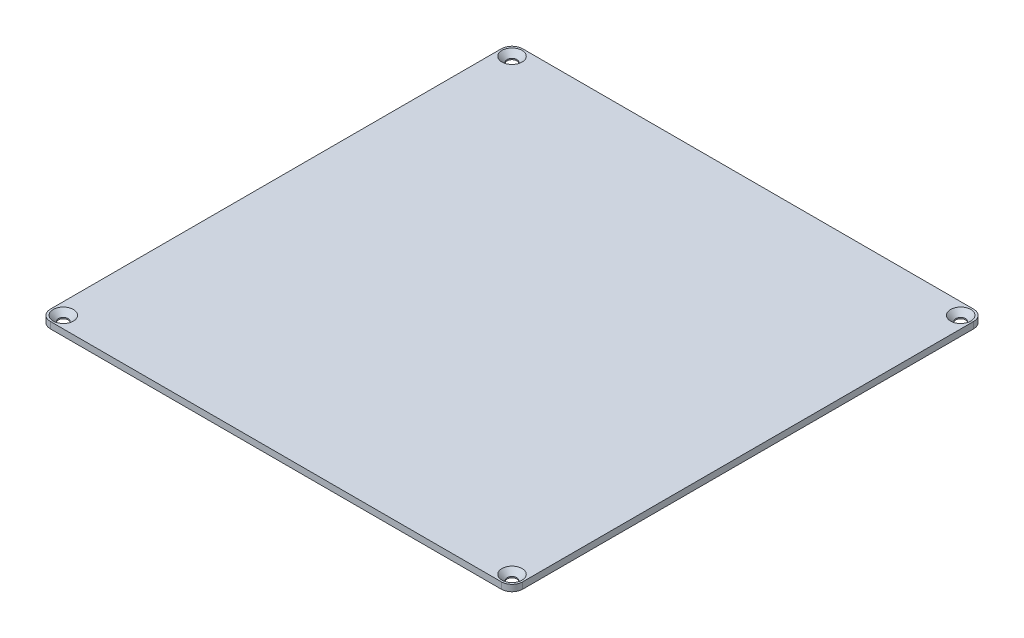
ISO-10303-21;
HEADER;
FILE_DESCRIPTION(('STEP AP214'),'2;1');
FILE_NAME('part.step','',(''),(''),'','','');
FILE_SCHEMA(('AUTOMOTIVE_DESIGN { 1 0 10303 214 1 1 1 1 }'));
ENDSEC;
DATA;
#1=APPLICATION_CONTEXT('core data for automotive mechanical design processes');
#2=APPLICATION_PROTOCOL_DEFINITION('international standard','automotive_design',2000,#1);
#3=PRODUCT_CONTEXT('',#1,'mechanical');
#4=PRODUCT('Part','Part','',(#3));
#5=PRODUCT_RELATED_PRODUCT_CATEGORY('part','',(#4));
#6=PRODUCT_DEFINITION_FORMATION('','',#4);
#7=PRODUCT_DEFINITION_CONTEXT('part definition',#1,'design');
#8=PRODUCT_DEFINITION('design','',#6,#7);
#9=PRODUCT_DEFINITION_SHAPE('','',#8);
#10=(LENGTH_UNIT() NAMED_UNIT(*) SI_UNIT(.MILLI.,.METRE.));
#11=(NAMED_UNIT(*) PLANE_ANGLE_UNIT() SI_UNIT($,.RADIAN.));
#12=(NAMED_UNIT(*) SI_UNIT($,.STERADIAN.) SOLID_ANGLE_UNIT());
#13=UNCERTAINTY_MEASURE_WITH_UNIT(LENGTH_MEASURE(1.E-05),#10,'distance_accuracy_value','');
#14=(GEOMETRIC_REPRESENTATION_CONTEXT(3) GLOBAL_UNCERTAINTY_ASSIGNED_CONTEXT((#13)) GLOBAL_UNIT_ASSIGNED_CONTEXT((#10,
#11,#12)) REPRESENTATION_CONTEXT('',''));
#15=CARTESIAN_POINT('',(0.,0.,0.));
#16=DIRECTION('',(0.,0.,1.));
#17=DIRECTION('',(1.,0.,0.));
#18=AXIS2_PLACEMENT_3D('',#15,#16,#17);
#19=CARTESIAN_POINT('',(0.,0.,0.));
#20=DIRECTION('',(0.,-1.,0.));
#21=DIRECTION('',(0.,0.,-1.));
#22=AXIS2_PLACEMENT_3D('',#19,#20,#21);
#23=PLANE('',#22);
#24=CARTESIAN_POINT('',(-104.5,0.,-104.5));
#25=DIRECTION('',(0.,1.,0.));
#26=DIRECTION('',(0.,0.,1.));
#27=AXIS2_PLACEMENT_3D('',#24,#25,#26);
#28=CIRCLE('',#27,2.25);
#29=CARTESIAN_POINT('',(-104.5,0.,-102.25));
#30=VERTEX_POINT('',#29);
#31=EDGE_CURVE('E210',#30,#30,#28,.T.);
#32=ORIENTED_EDGE('',*,*,#31,.T.);
#33=EDGE_LOOP('',(#32));
#34=FACE_BOUND('',#33,.T.);
#35=DIRECTION('',(-1.,0.,0.));
#36=VECTOR('',#35,1.);
#37=CARTESIAN_POINT('',(-110.,0.,-110.));
#38=LINE('',#37,#36);
#39=CARTESIAN_POINT('',(105.,0.,-110.));
#40=VERTEX_POINT('',#39);
#41=CARTESIAN_POINT('',(-105.,0.,-110.));
#42=VERTEX_POINT('',#41);
#43=EDGE_CURVE('E124',#40,#42,#38,.T.);
#44=ORIENTED_EDGE('',*,*,#43,.F.);
#45=CARTESIAN_POINT('',(105.,0.,-105.));
#46=DIRECTION('',(0.,-1.,0.));
#47=DIRECTION('',(0.,0.,-1.));
#48=AXIS2_PLACEMENT_3D('',#45,#46,#47);
#49=CIRCLE('',#48,5.);
#50=CARTESIAN_POINT('',(110.,0.,-105.));
#51=VERTEX_POINT('',#50);
#52=EDGE_CURVE('E107',#40,#51,#49,.T.);
#53=ORIENTED_EDGE('',*,*,#52,.T.);
#54=DIRECTION('',(0.,0.,-1.));
#55=VECTOR('',#54,1.);
#56=CARTESIAN_POINT('',(110.,0.,110.));
#57=LINE('',#56,#55);
#58=CARTESIAN_POINT('',(110.,0.,105.));
#59=VERTEX_POINT('',#58);
#60=EDGE_CURVE('E134',#59,#51,#57,.T.);
#61=ORIENTED_EDGE('',*,*,#60,.F.);
#62=CARTESIAN_POINT('',(105.,0.,105.));
#63=DIRECTION('',(0.,-1.,0.));
#64=DIRECTION('',(0.,0.,-1.));
#65=AXIS2_PLACEMENT_3D('',#62,#63,#64);
#66=CIRCLE('',#65,5.);
#67=CARTESIAN_POINT('',(105.,0.,110.));
#68=VERTEX_POINT('',#67);
#69=EDGE_CURVE('E128',#59,#68,#66,.T.);
#70=ORIENTED_EDGE('',*,*,#69,.T.);
#71=DIRECTION('',(1.,0.,0.));
#72=VECTOR('',#71,1.);
#73=CARTESIAN_POINT('',(-110.,0.,110.));
#74=LINE('',#73,#72);
#75=CARTESIAN_POINT('',(-105.,0.,110.));
#76=VERTEX_POINT('',#75);
#77=EDGE_CURVE('E137',#76,#68,#74,.T.);
#78=ORIENTED_EDGE('',*,*,#77,.F.);
#79=CARTESIAN_POINT('',(-105.,0.,105.));
#80=DIRECTION('',(0.,-1.,0.));
#81=DIRECTION('',(0.,0.,-1.));
#82=AXIS2_PLACEMENT_3D('',#79,#80,#81);
#83=CIRCLE('',#82,5.);
#84=CARTESIAN_POINT('',(-110.,0.,105.));
#85=VERTEX_POINT('',#84);
#86=EDGE_CURVE('E148',#76,#85,#83,.T.);
#87=ORIENTED_EDGE('',*,*,#86,.T.);
#88=DIRECTION('',(0.,0.,1.));
#89=VECTOR('',#88,1.);
#90=CARTESIAN_POINT('',(-110.,0.,110.));
#91=LINE('',#90,#89);
#92=CARTESIAN_POINT('',(-110.,0.,-105.));
#93=VERTEX_POINT('',#92);
#94=EDGE_CURVE('E133',#93,#85,#91,.T.);
#95=ORIENTED_EDGE('',*,*,#94,.F.);
#96=CARTESIAN_POINT('',(-105.,0.,-105.));
#97=DIRECTION('',(0.,-1.,0.));
#98=DIRECTION('',(0.,0.,-1.));
#99=AXIS2_PLACEMENT_3D('',#96,#97,#98);
#100=CIRCLE('',#99,5.);
#101=EDGE_CURVE('E118',#93,#42,#100,.T.);
#102=ORIENTED_EDGE('',*,*,#101,.T.);
#103=EDGE_LOOP('',(#44,#53,#61,#70,#78,#87,#95,#102));
#104=FACE_BOUND('',#103,.T.);
#105=CARTESIAN_POINT('',(104.5,0.,104.5));
#106=DIRECTION('',(0.,1.,0.));
#107=DIRECTION('',(0.,0.,1.));
#108=AXIS2_PLACEMENT_3D('',#105,#106,#107);
#109=CIRCLE('',#108,2.25);
#110=CARTESIAN_POINT('',(104.5,0.,106.75));
#111=VERTEX_POINT('',#110);
#112=EDGE_CURVE('E139',#111,#111,#109,.T.);
#113=ORIENTED_EDGE('',*,*,#112,.T.);
#114=EDGE_LOOP('',(#113));
#115=FACE_BOUND('',#114,.T.);
#116=CARTESIAN_POINT('',(-104.5,0.,104.5));
#117=DIRECTION('',(0.,1.,0.));
#118=DIRECTION('',(0.,0.,1.));
#119=AXIS2_PLACEMENT_3D('',#116,#117,#118);
#120=CIRCLE('',#119,2.25);
#121=CARTESIAN_POINT('',(-104.5,0.,106.75));
#122=VERTEX_POINT('',#121);
#123=EDGE_CURVE('E192',#122,#122,#120,.T.);
#124=ORIENTED_EDGE('',*,*,#123,.T.);
#125=EDGE_LOOP('',(#124));
#126=FACE_BOUND('',#125,.T.);
#127=CARTESIAN_POINT('',(104.5,0.,-104.5));
#128=DIRECTION('',(0.,1.,0.));
#129=DIRECTION('',(0.,0.,1.));
#130=AXIS2_PLACEMENT_3D('',#127,#128,#129);
#131=CIRCLE('',#130,2.25);
#132=CARTESIAN_POINT('',(104.5,0.,-102.25));
#133=VERTEX_POINT('',#132);
#134=EDGE_CURVE('E201',#133,#133,#131,.T.);
#135=ORIENTED_EDGE('',*,*,#134,.T.);
#136=EDGE_LOOP('',(#135));
#137=FACE_BOUND('',#136,.T.);
#138=ADVANCED_FACE('F41',(#34,#104,#115,#126,#137),#23,.T.);
#139=CARTESIAN_POINT('',(110.,3.,110.));
#140=DIRECTION('',(-1.,0.,0.));
#141=DIRECTION('',(0.,0.,1.));
#142=AXIS2_PLACEMENT_3D('',#139,#140,#141);
#143=PLANE('',#142);
#144=ORIENTED_EDGE('',*,*,#60,.T.);
#145=DIRECTION('',(0.,-1.,0.));
#146=VECTOR('',#145,1.);
#147=CARTESIAN_POINT('',(110.,3.,-105.));
#148=LINE('',#147,#146);
#149=CARTESIAN_POINT('',(110.,3.,-105.));
#150=VERTEX_POINT('',#149);
#151=EDGE_CURVE('E112',#51,#150,#148,.F.);
#152=ORIENTED_EDGE('',*,*,#151,.T.);
#153=DIRECTION('',(0.,0.,-1.));
#154=VECTOR('',#153,1.);
#155=CARTESIAN_POINT('',(110.,3.,110.));
#156=LINE('',#155,#154);
#157=CARTESIAN_POINT('',(110.,3.,105.));
#158=VERTEX_POINT('',#157);
#159=EDGE_CURVE('E144',#158,#150,#156,.T.);
#160=ORIENTED_EDGE('',*,*,#159,.F.);
#161=DIRECTION('',(0.,-1.,0.));
#162=VECTOR('',#161,1.);
#163=CARTESIAN_POINT('',(110.,3.,105.));
#164=LINE('',#163,#162);
#165=EDGE_CURVE('E117',#158,#59,#164,.T.);
#166=ORIENTED_EDGE('',*,*,#165,.T.);
#167=EDGE_LOOP('',(#144,#152,#160,#166));
#168=FACE_BOUND('',#167,.T.);
#169=ADVANCED_FACE('F234',(#168),#143,.F.);
#170=CARTESIAN_POINT('',(-110.,3.,-110.));
#171=DIRECTION('',(0.,0.,1.));
#172=DIRECTION('',(1.,0.,0.));
#173=AXIS2_PLACEMENT_3D('',#170,#171,#172);
#174=PLANE('',#173);
#175=DIRECTION('',(-1.,0.,0.));
#176=VECTOR('',#175,1.);
#177=CARTESIAN_POINT('',(-110.,3.,-110.));
#178=LINE('',#177,#176);
#179=CARTESIAN_POINT('',(105.,3.,-110.));
#180=VERTEX_POINT('',#179);
#181=CARTESIAN_POINT('',(-105.,3.,-110.));
#182=VERTEX_POINT('',#181);
#183=EDGE_CURVE('E127',#180,#182,#178,.T.);
#184=ORIENTED_EDGE('',*,*,#183,.F.);
#185=DIRECTION('',(0.,-1.,0.));
#186=VECTOR('',#185,1.);
#187=CARTESIAN_POINT('',(105.,3.,-110.));
#188=LINE('',#187,#186);
#189=EDGE_CURVE('E111',#180,#40,#188,.T.);
#190=ORIENTED_EDGE('',*,*,#189,.T.);
#191=ORIENTED_EDGE('',*,*,#43,.T.);
#192=DIRECTION('',(0.,-1.,0.));
#193=VECTOR('',#192,1.);
#194=CARTESIAN_POINT('',(-105.,3.,-110.));
#195=LINE('',#194,#193);
#196=EDGE_CURVE('E129',#42,#182,#195,.F.);
#197=ORIENTED_EDGE('',*,*,#196,.T.);
#198=EDGE_LOOP('',(#184,#190,#191,#197));
#199=FACE_BOUND('',#198,.T.);
#200=ADVANCED_FACE('F123',(#199),#174,.F.);
#201=CARTESIAN_POINT('',(-110.,3.,110.));
#202=DIRECTION('',(1.,0.,0.));
#203=DIRECTION('',(0.,0.,-1.));
#204=AXIS2_PLACEMENT_3D('',#201,#202,#203);
#205=PLANE('',#204);
#206=DIRECTION('',(0.,0.,1.));
#207=VECTOR('',#206,1.);
#208=CARTESIAN_POINT('',(-110.,3.,110.));
#209=LINE('',#208,#207);
#210=CARTESIAN_POINT('',(-110.,3.,-105.));
#211=VERTEX_POINT('',#210);
#212=CARTESIAN_POINT('',(-110.,3.,105.));
#213=VERTEX_POINT('',#212);
#214=EDGE_CURVE('E170',#211,#213,#209,.T.);
#215=ORIENTED_EDGE('',*,*,#214,.F.);
#216=DIRECTION('',(0.,-1.,0.));
#217=VECTOR('',#216,1.);
#218=CARTESIAN_POINT('',(-110.,3.,-105.));
#219=LINE('',#218,#217);
#220=EDGE_CURVE('E163',#211,#93,#219,.T.);
#221=ORIENTED_EDGE('',*,*,#220,.T.);
#222=ORIENTED_EDGE('',*,*,#94,.T.);
#223=DIRECTION('',(0.,-1.,0.));
#224=VECTOR('',#223,1.);
#225=CARTESIAN_POINT('',(-110.,3.,105.));
#226=LINE('',#225,#224);
#227=EDGE_CURVE('E161',#85,#213,#226,.F.);
#228=ORIENTED_EDGE('',*,*,#227,.T.);
#229=EDGE_LOOP('',(#215,#221,#222,#228));
#230=FACE_BOUND('',#229,.T.);
#231=ADVANCED_FACE('F168',(#230),#205,.F.);
#232=CARTESIAN_POINT('',(-110.,3.,110.));
#233=DIRECTION('',(0.,0.,-1.));
#234=DIRECTION('',(-1.,0.,0.));
#235=AXIS2_PLACEMENT_3D('',#232,#233,#234);
#236=PLANE('',#235);
#237=DIRECTION('',(1.,0.,0.));
#238=VECTOR('',#237,1.);
#239=CARTESIAN_POINT('',(-110.,3.,110.));
#240=LINE('',#239,#238);
#241=CARTESIAN_POINT('',(-105.,3.,110.));
#242=VERTEX_POINT('',#241);
#243=CARTESIAN_POINT('',(105.,3.,110.));
#244=VERTEX_POINT('',#243);
#245=EDGE_CURVE('E145',#242,#244,#240,.T.);
#246=ORIENTED_EDGE('',*,*,#245,.F.);
#247=DIRECTION('',(0.,-1.,0.));
#248=VECTOR('',#247,1.);
#249=CARTESIAN_POINT('',(-105.,3.,110.));
#250=LINE('',#249,#248);
#251=EDGE_CURVE('E11',#242,#76,#250,.T.);
#252=ORIENTED_EDGE('',*,*,#251,.T.);
#253=ORIENTED_EDGE('',*,*,#77,.T.);
#254=DIRECTION('',(0.,-1.,0.));
#255=VECTOR('',#254,1.);
#256=CARTESIAN_POINT('',(105.,3.,110.));
#257=LINE('',#256,#255);
#258=EDGE_CURVE('E49',#68,#244,#257,.F.);
#259=ORIENTED_EDGE('',*,*,#258,.T.);
#260=EDGE_LOOP('',(#246,#252,#253,#259));
#261=FACE_BOUND('',#260,.T.);
#262=ADVANCED_FACE('F177',(#261),#236,.F.);
#263=CARTESIAN_POINT('',(0.,3.,0.));
#264=DIRECTION('',(0.,-1.,0.));
#265=DIRECTION('',(0.,0.,-1.));
#266=AXIS2_PLACEMENT_3D('',#263,#264,#265);
#267=PLANE('',#266);
#268=CARTESIAN_POINT('',(-104.5,3.,-104.5));
#269=DIRECTION('',(0.,1.,0.));
#270=DIRECTION('',(0.,0.,1.));
#271=AXIS2_PLACEMENT_3D('',#268,#269,#270);
#272=CIRCLE('',#271,4.7);
#273=CARTESIAN_POINT('',(-104.5,3.,-99.8));
#274=VERTEX_POINT('',#273);
#275=EDGE_CURVE('E216',#274,#274,#272,.T.);
#276=ORIENTED_EDGE('',*,*,#275,.F.);
#277=EDGE_LOOP('',(#276));
#278=FACE_BOUND('',#277,.T.);
#279=CARTESIAN_POINT('',(104.5,3.,-104.5));
#280=DIRECTION('',(0.,1.,0.));
#281=DIRECTION('',(0.,0.,1.));
#282=AXIS2_PLACEMENT_3D('',#279,#280,#281);
#283=CIRCLE('',#282,4.7);
#284=CARTESIAN_POINT('',(104.5,3.,-99.8));
#285=VERTEX_POINT('',#284);
#286=EDGE_CURVE('E207',#285,#285,#283,.T.);
#287=ORIENTED_EDGE('',*,*,#286,.F.);
#288=EDGE_LOOP('',(#287));
#289=FACE_BOUND('',#288,.T.);
#290=CARTESIAN_POINT('',(-104.5,3.,104.5));
#291=DIRECTION('',(0.,1.,0.));
#292=DIRECTION('',(0.,0.,1.));
#293=AXIS2_PLACEMENT_3D('',#290,#291,#292);
#294=CIRCLE('',#293,4.7);
#295=CARTESIAN_POINT('',(-104.5,3.,109.2));
#296=VERTEX_POINT('',#295);
#297=EDGE_CURVE('E198',#296,#296,#294,.T.);
#298=ORIENTED_EDGE('',*,*,#297,.F.);
#299=EDGE_LOOP('',(#298));
#300=FACE_BOUND('',#299,.T.);
#301=CARTESIAN_POINT('',(104.5,3.,104.5));
#302=DIRECTION('',(0.,1.,0.));
#303=DIRECTION('',(0.,0.,1.));
#304=AXIS2_PLACEMENT_3D('',#301,#302,#303);
#305=CIRCLE('',#304,4.7);
#306=CARTESIAN_POINT('',(104.5,3.,109.2));
#307=VERTEX_POINT('',#306);
#308=EDGE_CURVE('E189',#307,#307,#305,.T.);
#309=ORIENTED_EDGE('',*,*,#308,.F.);
#310=EDGE_LOOP('',(#309));
#311=FACE_BOUND('',#310,.T.);
#312=ORIENTED_EDGE('',*,*,#159,.T.);
#313=CARTESIAN_POINT('',(105.,3.,-105.));
#314=DIRECTION('',(0.,-1.,0.));
#315=DIRECTION('',(0.,0.,-1.));
#316=AXIS2_PLACEMENT_3D('',#313,#314,#315);
#317=CIRCLE('',#316,5.);
#318=EDGE_CURVE('E159',#150,#180,#317,.F.);
#319=ORIENTED_EDGE('',*,*,#318,.T.);
#320=ORIENTED_EDGE('',*,*,#183,.T.);
#321=CARTESIAN_POINT('',(-105.,3.,-105.));
#322=DIRECTION('',(0.,-1.,0.));
#323=DIRECTION('',(0.,0.,-1.));
#324=AXIS2_PLACEMENT_3D('',#321,#322,#323);
#325=CIRCLE('',#324,5.);
#326=EDGE_CURVE('E157',#182,#211,#325,.F.);
#327=ORIENTED_EDGE('',*,*,#326,.T.);
#328=ORIENTED_EDGE('',*,*,#214,.T.);
#329=CARTESIAN_POINT('',(-105.,3.,105.));
#330=DIRECTION('',(0.,-1.,0.));
#331=DIRECTION('',(0.,0.,-1.));
#332=AXIS2_PLACEMENT_3D('',#329,#330,#331);
#333=CIRCLE('',#332,5.);
#334=EDGE_CURVE('E62',#213,#242,#333,.F.);
#335=ORIENTED_EDGE('',*,*,#334,.T.);
#336=ORIENTED_EDGE('',*,*,#245,.T.);
#337=CARTESIAN_POINT('',(105.,3.,105.));
#338=DIRECTION('',(0.,-1.,0.));
#339=DIRECTION('',(0.,0.,-1.));
#340=AXIS2_PLACEMENT_3D('',#337,#338,#339);
#341=CIRCLE('',#340,5.);
#342=EDGE_CURVE('E154',#244,#158,#341,.F.);
#343=ORIENTED_EDGE('',*,*,#342,.T.);
#344=EDGE_LOOP('',(#312,#319,#320,#327,#328,#335,#336,#343));
#345=FACE_BOUND('',#344,.T.);
#346=ADVANCED_FACE('F222',(#278,#289,#300,#311,#345),#267,.F.);
#347=CARTESIAN_POINT('',(105.,3.,-105.));
#348=DIRECTION('',(0.,-1.,0.));
#349=DIRECTION('',(0.,0.,-1.));
#350=AXIS2_PLACEMENT_3D('',#347,#348,#349);
#351=CYLINDRICAL_SURFACE('',#350,5.);
#352=ORIENTED_EDGE('',*,*,#318,.F.);
#353=ORIENTED_EDGE('',*,*,#151,.F.);
#354=ORIENTED_EDGE('',*,*,#52,.F.);
#355=ORIENTED_EDGE('',*,*,#189,.F.);
#356=EDGE_LOOP('',(#352,#353,#354,#355));
#357=FACE_BOUND('',#356,.T.);
#358=ADVANCED_FACE('F110',(#357),#351,.T.);
#359=CARTESIAN_POINT('',(-105.,3.,-105.));
#360=DIRECTION('',(0.,-1.,0.));
#361=DIRECTION('',(0.,0.,-1.));
#362=AXIS2_PLACEMENT_3D('',#359,#360,#361);
#363=CYLINDRICAL_SURFACE('',#362,5.);
#364=ORIENTED_EDGE('',*,*,#326,.F.);
#365=ORIENTED_EDGE('',*,*,#196,.F.);
#366=ORIENTED_EDGE('',*,*,#101,.F.);
#367=ORIENTED_EDGE('',*,*,#220,.F.);
#368=EDGE_LOOP('',(#364,#365,#366,#367));
#369=FACE_BOUND('',#368,.T.);
#370=ADVANCED_FACE('F246',(#369),#363,.T.);
#371=CARTESIAN_POINT('',(-105.,3.,105.));
#372=DIRECTION('',(0.,-1.,0.));
#373=DIRECTION('',(0.,0.,-1.));
#374=AXIS2_PLACEMENT_3D('',#371,#372,#373);
#375=CYLINDRICAL_SURFACE('',#374,5.);
#376=ORIENTED_EDGE('',*,*,#334,.F.);
#377=ORIENTED_EDGE('',*,*,#227,.F.);
#378=ORIENTED_EDGE('',*,*,#86,.F.);
#379=ORIENTED_EDGE('',*,*,#251,.F.);
#380=EDGE_LOOP('',(#376,#377,#378,#379));
#381=FACE_BOUND('',#380,.T.);
#382=ADVANCED_FACE('F176',(#381),#375,.T.);
#383=CARTESIAN_POINT('',(105.,3.,105.));
#384=DIRECTION('',(0.,-1.,0.));
#385=DIRECTION('',(0.,0.,-1.));
#386=AXIS2_PLACEMENT_3D('',#383,#384,#385);
#387=CYLINDRICAL_SURFACE('',#386,5.);
#388=ORIENTED_EDGE('',*,*,#342,.F.);
#389=ORIENTED_EDGE('',*,*,#258,.F.);
#390=ORIENTED_EDGE('',*,*,#69,.F.);
#391=ORIENTED_EDGE('',*,*,#165,.F.);
#392=EDGE_LOOP('',(#388,#389,#390,#391));
#393=FACE_BOUND('',#392,.T.);
#394=ADVANCED_FACE('F43',(#393),#387,.T.);
#395=CARTESIAN_POINT('',(104.5,3.,104.5));
#396=DIRECTION('',(0.,1.,0.));
#397=DIRECTION('',(0.,0.,1.));
#398=AXIS2_PLACEMENT_3D('',#395,#396,#397);
#399=CYLINDRICAL_SURFACE('',#398,2.25);
#400=ORIENTED_EDGE('',*,*,#112,.F.);
#401=EDGE_LOOP('',(#400));
#402=FACE_BOUND('',#401,.T.);
#403=CARTESIAN_POINT('',(104.5,0.55,104.5));
#404=DIRECTION('',(0.,1.,0.));
#405=DIRECTION('',(0.,0.,1.));
#406=AXIS2_PLACEMENT_3D('',#403,#404,#405);
#407=CIRCLE('',#406,2.25);
#408=CARTESIAN_POINT('',(104.5,0.55,106.75));
#409=VERTEX_POINT('',#408);
#410=EDGE_CURVE('E186',#409,#409,#407,.T.);
#411=ORIENTED_EDGE('',*,*,#410,.T.);
#412=EDGE_LOOP('',(#411));
#413=FACE_BOUND('',#412,.T.);
#414=ADVANCED_FACE('F237',(#402,#413),#399,.F.);
#415=CARTESIAN_POINT('',(104.5,3.,104.5));
#416=DIRECTION('',(0.,1.,0.));
#417=DIRECTION('',(0.,0.,1.));
#418=AXIS2_PLACEMENT_3D('',#415,#416,#417);
#419=CONICAL_SURFACE('',#418,4.7,0.785398163397447);
#420=ORIENTED_EDGE('',*,*,#410,.F.);
#421=EDGE_LOOP('',(#420));
#422=FACE_BOUND('',#421,.T.);
#423=ORIENTED_EDGE('',*,*,#308,.T.);
#424=EDGE_LOOP('',(#423));
#425=FACE_BOUND('',#424,.T.);
#426=ADVANCED_FACE('F243',(#422,#425),#419,.F.);
#427=CARTESIAN_POINT('',(-104.5,3.,104.5));
#428=DIRECTION('',(0.,1.,0.));
#429=DIRECTION('',(0.,0.,1.));
#430=AXIS2_PLACEMENT_3D('',#427,#428,#429);
#431=CYLINDRICAL_SURFACE('',#430,2.25);
#432=ORIENTED_EDGE('',*,*,#123,.F.);
#433=EDGE_LOOP('',(#432));
#434=FACE_BOUND('',#433,.T.);
#435=CARTESIAN_POINT('',(-104.5,0.55,104.5));
#436=DIRECTION('',(0.,1.,0.));
#437=DIRECTION('',(0.,0.,1.));
#438=AXIS2_PLACEMENT_3D('',#435,#436,#437);
#439=CIRCLE('',#438,2.25);
#440=CARTESIAN_POINT('',(-104.5,0.55,106.75));
#441=VERTEX_POINT('',#440);
#442=EDGE_CURVE('E195',#441,#441,#439,.T.);
#443=ORIENTED_EDGE('',*,*,#442,.T.);
#444=EDGE_LOOP('',(#443));
#445=FACE_BOUND('',#444,.T.);
#446=ADVANCED_FACE('F296',(#434,#445),#431,.F.);
#447=CARTESIAN_POINT('',(-104.5,3.,104.5));
#448=DIRECTION('',(0.,1.,0.));
#449=DIRECTION('',(0.,0.,1.));
#450=AXIS2_PLACEMENT_3D('',#447,#448,#449);
#451=CONICAL_SURFACE('',#450,4.7,0.785398163397447);
#452=ORIENTED_EDGE('',*,*,#442,.F.);
#453=EDGE_LOOP('',(#452));
#454=FACE_BOUND('',#453,.T.);
#455=ORIENTED_EDGE('',*,*,#297,.T.);
#456=EDGE_LOOP('',(#455));
#457=FACE_BOUND('',#456,.T.);
#458=ADVANCED_FACE('F306',(#454,#457),#451,.F.);
#459=CARTESIAN_POINT('',(104.5,3.,-104.5));
#460=DIRECTION('',(0.,1.,0.));
#461=DIRECTION('',(0.,0.,1.));
#462=AXIS2_PLACEMENT_3D('',#459,#460,#461);
#463=CYLINDRICAL_SURFACE('',#462,2.25);
#464=ORIENTED_EDGE('',*,*,#134,.F.);
#465=EDGE_LOOP('',(#464));
#466=FACE_BOUND('',#465,.T.);
#467=CARTESIAN_POINT('',(104.5,0.55,-104.5));
#468=DIRECTION('',(0.,1.,0.));
#469=DIRECTION('',(0.,0.,1.));
#470=AXIS2_PLACEMENT_3D('',#467,#468,#469);
#471=CIRCLE('',#470,2.25);
#472=CARTESIAN_POINT('',(104.5,0.55,-102.25));
#473=VERTEX_POINT('',#472);
#474=EDGE_CURVE('E204',#473,#473,#471,.T.);
#475=ORIENTED_EDGE('',*,*,#474,.T.);
#476=EDGE_LOOP('',(#475));
#477=FACE_BOUND('',#476,.T.);
#478=ADVANCED_FACE('F316',(#466,#477),#463,.F.);
#479=CARTESIAN_POINT('',(104.5,3.,-104.5));
#480=DIRECTION('',(0.,1.,0.));
#481=DIRECTION('',(0.,0.,1.));
#482=AXIS2_PLACEMENT_3D('',#479,#480,#481);
#483=CONICAL_SURFACE('',#482,4.7,0.785398163397447);
#484=ORIENTED_EDGE('',*,*,#474,.F.);
#485=EDGE_LOOP('',(#484));
#486=FACE_BOUND('',#485,.T.);
#487=ORIENTED_EDGE('',*,*,#286,.T.);
#488=EDGE_LOOP('',(#487));
#489=FACE_BOUND('',#488,.T.);
#490=ADVANCED_FACE('F326',(#486,#489),#483,.F.);
#491=CARTESIAN_POINT('',(-104.5,3.,-104.5));
#492=DIRECTION('',(0.,1.,0.));
#493=DIRECTION('',(0.,0.,1.));
#494=AXIS2_PLACEMENT_3D('',#491,#492,#493);
#495=CYLINDRICAL_SURFACE('',#494,2.25);
#496=ORIENTED_EDGE('',*,*,#31,.F.);
#497=EDGE_LOOP('',(#496));
#498=FACE_BOUND('',#497,.T.);
#499=CARTESIAN_POINT('',(-104.5,0.55,-104.5));
#500=DIRECTION('',(0.,1.,0.));
#501=DIRECTION('',(0.,0.,1.));
#502=AXIS2_PLACEMENT_3D('',#499,#500,#501);
#503=CIRCLE('',#502,2.25);
#504=CARTESIAN_POINT('',(-104.5,0.55,-102.25));
#505=VERTEX_POINT('',#504);
#506=EDGE_CURVE('E213',#505,#505,#503,.T.);
#507=ORIENTED_EDGE('',*,*,#506,.T.);
#508=EDGE_LOOP('',(#507));
#509=FACE_BOUND('',#508,.T.);
#510=ADVANCED_FACE('F336',(#498,#509),#495,.F.);
#511=CARTESIAN_POINT('',(-104.5,3.,-104.5));
#512=DIRECTION('',(0.,1.,0.));
#513=DIRECTION('',(0.,0.,1.));
#514=AXIS2_PLACEMENT_3D('',#511,#512,#513);
#515=CONICAL_SURFACE('',#514,4.7,0.785398163397447);
#516=ORIENTED_EDGE('',*,*,#506,.F.);
#517=EDGE_LOOP('',(#516));
#518=FACE_BOUND('',#517,.T.);
#519=ORIENTED_EDGE('',*,*,#275,.T.);
#520=EDGE_LOOP('',(#519));
#521=FACE_BOUND('',#520,.T.);
#522=ADVANCED_FACE('F220',(#518,#521),#515,.F.);
#523=CLOSED_SHELL('',(#138,#169,#200,#231,#262,#346,#358,#370,#382,#394,#414,#426,#446,#458,
#478,#490,#510,#522));
#524=MANIFOLD_SOLID_BREP('B2',#523);
#525=ADVANCED_BREP_SHAPE_REPRESENTATION('',(#18,#524),#14);
#526=SHAPE_DEFINITION_REPRESENTATION(#9,#525);
ENDSEC;
END-ISO-10303-21;
